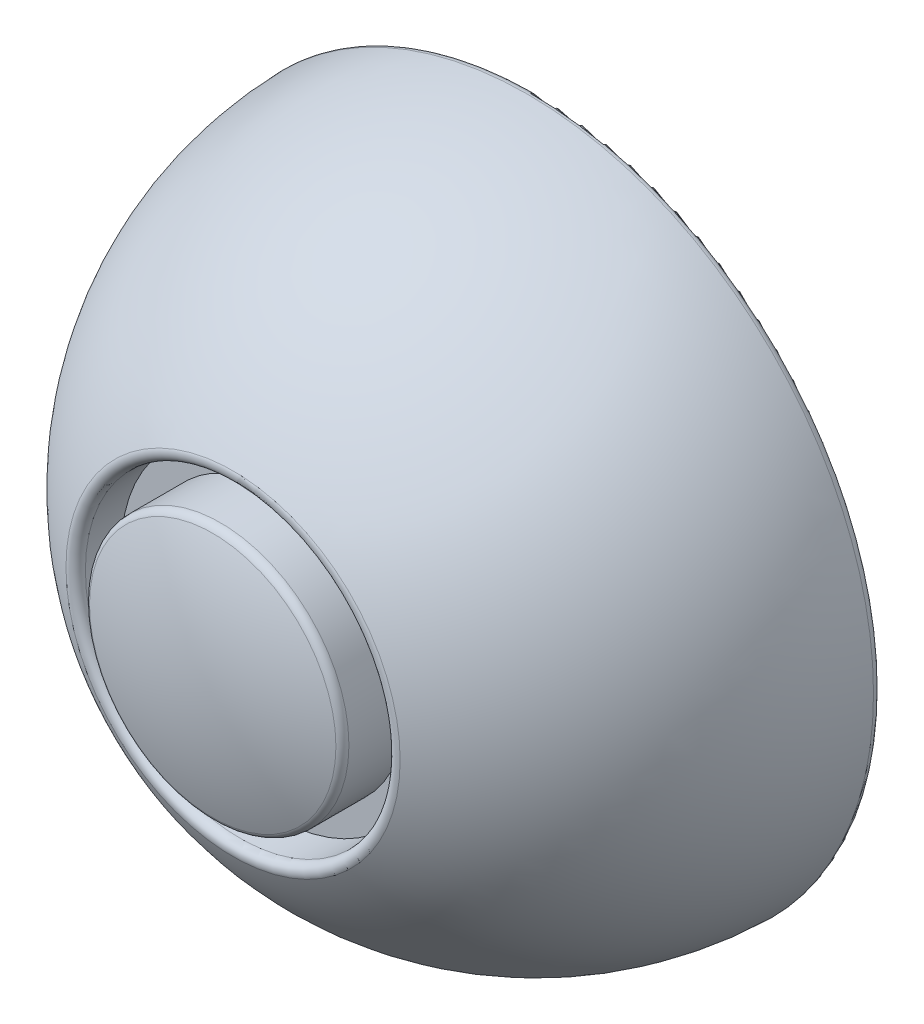
ISO-10303-21;
HEADER;
FILE_DESCRIPTION(('STEP AP214'),'2;1');
FILE_NAME('part.step','',(''),(''),'','','');
FILE_SCHEMA(('AUTOMOTIVE_DESIGN { 1 0 10303 214 1 1 1 1 }'));
ENDSEC;
DATA;
#1=APPLICATION_CONTEXT('core data for automotive mechanical design processes');
#2=APPLICATION_PROTOCOL_DEFINITION('international standard','automotive_design',2000,#1);
#3=PRODUCT_CONTEXT('',#1,'mechanical');
#4=PRODUCT('Part','Part','',(#3));
#5=PRODUCT_RELATED_PRODUCT_CATEGORY('part','',(#4));
#6=PRODUCT_DEFINITION_FORMATION('','',#4);
#7=PRODUCT_DEFINITION_CONTEXT('part definition',#1,'design');
#8=PRODUCT_DEFINITION('design','',#6,#7);
#9=PRODUCT_DEFINITION_SHAPE('','',#8);
#10=(LENGTH_UNIT() NAMED_UNIT(*) SI_UNIT(.MILLI.,.METRE.));
#11=(NAMED_UNIT(*) PLANE_ANGLE_UNIT() SI_UNIT($,.RADIAN.));
#12=(NAMED_UNIT(*) SI_UNIT($,.STERADIAN.) SOLID_ANGLE_UNIT());
#13=UNCERTAINTY_MEASURE_WITH_UNIT(LENGTH_MEASURE(1.E-05),#10,'distance_accuracy_value','');
#14=(GEOMETRIC_REPRESENTATION_CONTEXT(3) GLOBAL_UNCERTAINTY_ASSIGNED_CONTEXT((#13)) GLOBAL_UNIT_ASSIGNED_CONTEXT((#10,
#11,#12)) REPRESENTATION_CONTEXT('',''));
#15=CARTESIAN_POINT('',(0.,0.,0.));
#16=DIRECTION('',(0.,0.,1.));
#17=DIRECTION('',(1.,0.,0.));
#18=AXIS2_PLACEMENT_3D('',#15,#16,#17);
#19=CARTESIAN_POINT('',(0.,0.,0.));
#20=DIRECTION('',(0.,0.,-1.));
#21=DIRECTION('',(1.,0.,0.));
#22=AXIS2_PLACEMENT_3D('',#19,#20,#21);
#23=SPHERICAL_SURFACE('',#22,10.5);
#24=CARTESIAN_POINT('',(0.,0.,0.256097560975609));
#25=DIRECTION('',(0.,0.,-1.));
#26=DIRECTION('',(-1.,0.,0.));
#27=AXIS2_PLACEMENT_3D('',#24,#25,#26);
#28=CIRCLE('',#27,10.4968763943976);
#29=CARTESIAN_POINT('',(10.4968763943976,0.,0.256097560975609));
#30=VERTEX_POINT('',#29);
#31=EDGE_CURVE('E66',#30,#30,#28,.F.);
#32=CARTESIAN_POINT('',(0.,0.,9.19443744621765));
#33=DIRECTION('',(0.,0.,-1.));
#34=DIRECTION('',(-1.,0.,0.));
#35=AXIS2_PLACEMENT_3D('',#32,#33,#34);
#36=CIRCLE('',#35,5.07073170731707);
#37=CARTESIAN_POINT('',(5.07073170731707,0.,9.19443744621765));
#38=VERTEX_POINT('',#37);
#39=EDGE_CURVE('E57',#38,#38,#36,.T.);
#40=CARTESIAN_POINT('',(10.4968763943976,0.,0.256097560975609));
#41=CARTESIAN_POINT('',(10.4940962826482,0.,0.370077232707731));
#42=CARTESIAN_POINT('',(10.4894583226559,0.,0.484011537651241));
#43=CARTESIAN_POINT('',(10.4764747300092,0.,0.711668700190832));
#44=CARTESIAN_POINT('',(10.4681290973549,0.,0.825391557786914));
#45=CARTESIAN_POINT('',(10.4477381832081,0.,1.05250511186145));
#46=CARTESIAN_POINT('',(10.4356929017156,0.,1.1658958083399));
#47=CARTESIAN_POINT('',(10.4079156933777,0.,1.39222473896705));
#48=CARTESIAN_POINT('',(10.3921837665321,0.,1.50516297311575));
#49=CARTESIAN_POINT('',(10.3570499002595,0.,1.73046714185113));
#50=CARTESIAN_POINT('',(10.3376479608324,0.,1.84283307643783));
#51=CARTESIAN_POINT('',(10.2951946719407,0.,2.06687342037519));
#52=CARTESIAN_POINT('',(10.2721433224762,0.,2.17854782972586));
#53=CARTESIAN_POINT('',(10.2224156680047,0.,2.40108663010789));
#54=CARTESIAN_POINT('',(10.1957393629976,0.,2.51195102113924));
#55=CARTESIAN_POINT('',(10.1387901036515,0.,2.73275215158429));
#56=CARTESIAN_POINT('',(10.1085171493125,0.,2.84268889099798));
#57=CARTESIAN_POINT('',(10.0444067123045,0.,3.06151806911693));
#58=CARTESIAN_POINT('',(10.0105692296356,0.,3.1704105078222));
#59=CARTESIAN_POINT('',(9.93936563952546,0.,3.38703554351767));
#60=CARTESIAN_POINT('',(9.90199953208428,0.,3.49476814050788));
#61=CARTESIAN_POINT('',(9.82377833995237,0.,3.70895918241803));
#62=CARTESIAN_POINT('',(9.78292325526165,0.,3.81541762733798));
#63=CARTESIAN_POINT('',(9.6977674581828,0.,4.02694740670112));
#64=CARTESIAN_POINT('',(9.65346674579467,0.,4.13201874114432));
#65=CARTESIAN_POINT('',(9.5614666988707,0.,4.3406628129494));
#66=CARTESIAN_POINT('',(9.51376736433487,0.,4.44423555031129));
#67=CARTESIAN_POINT('',(9.41502068479673,0.,4.64977253144522));
#68=CARTESIAN_POINT('',(9.36397333979444,0.,4.75173677521727));
#69=CARTESIAN_POINT('',(9.25858480343181,0.,4.95394857936527));
#70=CARTESIAN_POINT('',(9.20424361207147,0.,5.05419613974122));
#71=CARTESIAN_POINT('',(9.09232504205782,0.,5.25286820878856));
#72=CARTESIAN_POINT('',(9.03474766340452,0.,5.35129271745995));
#73=CARTESIAN_POINT('',(8.91641781164701,0.,5.54621424915026));
#74=CARTESIAN_POINT('',(8.8556653385428,0.,5.64271127216917));
#75=CARTESIAN_POINT('',(8.73104975967961,0.,5.83367544377746));
#76=CARTESIAN_POINT('',(8.66718665392062,0.,5.92814259236684));
#77=CARTESIAN_POINT('',(8.53641757210045,0.,6.11494678015008));
#78=CARTESIAN_POINT('',(8.46951159603927,0.,6.20728381934395));
#79=CARTESIAN_POINT('',(8.33272776462416,0.,6.38972981353637));
#80=CARTESIAN_POINT('',(8.26284990927024,0.,6.47983876853492));
#81=CARTESIAN_POINT('',(8.12019646361013,0.,6.6577329836593));
#82=CARTESIAN_POINT('',(8.04742087330396,0.,6.74551824378512));
#83=CARTESIAN_POINT('',(7.89904917674092,0.,6.9186719240595));
#84=CARTESIAN_POINT('',(7.82345307048406,0.,7.00404034420805));
#85=CARTESIAN_POINT('',(7.66952055374364,0.,7.17226976382024));
#86=CARTESIAN_POINT('',(7.59118414326009,0.,7.25513076328388));
#87=CARTESIAN_POINT('',(7.43185413742179,0.,7.41825742135729));
#88=CARTESIAN_POINT('',(7.35086054206705,0.,7.49852307996707));
#89=CARTESIAN_POINT('',(7.18630210521116,0.,7.65637388987668));
#90=CARTESIAN_POINT('',(7.10273726371002,0.,7.73395904117651));
#91=CARTESIAN_POINT('',(6.93312500172289,0.,7.88636651451523));
#92=CARTESIAN_POINT('',(6.84707758123691,0.,7.96118883655411));
#93=CARTESIAN_POINT('',(6.6725914618523,0.,8.10799125968401));
#94=CARTESIAN_POINT('',(6.58415276295367,0.,8.17997136077503));
#95=CARTESIAN_POINT('',(6.40497792737928,0.,8.32101297075655));
#96=CARTESIAN_POINT('',(6.31424179070352,0.,8.39007447964705));
#97=CARTESIAN_POINT('',(6.13056834753793,0.,8.52520561330804));
#98=CARTESIAN_POINT('',(6.03763104104809,0.,8.59127523807853));
#99=CARTESIAN_POINT('',(5.84965390053375,0.,8.72035255129015));
#100=CARTESIAN_POINT('',(5.75461406650925,0.,8.78336023973129));
#101=CARTESIAN_POINT('',(5.56253259948371,0.,8.90624663380902));
#102=CARTESIAN_POINT('',(5.46549096648269,0.,8.96612533944562));
#103=CARTESIAN_POINT('',(5.26950929381819,0.,9.08269094892466));
#104=CARTESIAN_POINT('',(5.17056925415472,0.,9.1393778527671));
#105=CARTESIAN_POINT('',(5.07073170731707,0.,9.19443744621765));
#106=B_SPLINE_CURVE_WITH_KNOTS('',3,(#40,#41,#42,#43,#44,#45,#46,#47,#48,#49,#50,#51,#52,#53,
#54,#55,#56,#57,#58,#59,#60,#61,#62,#63,#64,#65,#66,#67,#68,#69,#70,#71,#72,#73,#74,#75,#76,#77,
#78,#79,#80,#81,#82,#83,#84,#85,#86,#87,#88,#89,#90,#91,#92,#93,#94,#95,#96,#97,#98,#99,#100,
#101,#102,#103,#104,#105),.UNSPECIFIED.,.F.,.F.,(4,2,2,2,2,2,2,2,2,2,2,2,2,2,2,2,2,2,2,2,2,2,2,
2,2,2,2,2,2,2,2,2,4),(0.,0.342025525861261,0.684051051722522,1.02607657758378,1.36810210344504,
1.7101276293063,2.05215315516757,2.39417868102883,2.73620420689009,3.07822973275135,
3.42025525861261,3.76228078447387,4.10430631033513,4.44633183619639,4.78835736205765,
5.13038288791891,5.47240841378017,5.81443393964143,6.15645946550269,6.49848499136395,
6.84051051722522,7.18253604308648,7.52456156894774,7.866587094809,8.20861262067026,
8.55063814653152,8.89266367239278,9.23468919825404,9.5767147241153,9.91874024997656,
10.2607657758378,10.6027913016991,10.9448168275603),.UNSPECIFIED.);
#107=EDGE_CURVE('BSEAM32',#30,#38,#106,.T.);
#108=ORIENTED_EDGE('',*,*,#31,.T.);
#109=ORIENTED_EDGE('',*,*,#39,.T.);
#110=ORIENTED_EDGE('',*,*,#107,.T.);
#111=ORIENTED_EDGE('',*,*,#107,.F.);
#112=EDGE_LOOP('',(#108,#110,#109,#111));
#113=FACE_BOUND('',#112,.T.);
#114=ADVANCED_FACE('F32',(#113),#23,.T.);
#115=CARTESIAN_POINT('',(0.,0.,0.));
#116=DIRECTION('',(0.,0.,-1.));
#117=DIRECTION('',(1.,0.,0.));
#118=AXIS2_PLACEMENT_3D('',#115,#116,#117);
#119=SPHERICAL_SURFACE('',#118,10.);
#120=CARTESIAN_POINT('',(0.,0.,0.24390243902439));
#121=DIRECTION('',(0.,0.,-1.));
#122=DIRECTION('',(-1.,0.,0.));
#123=AXIS2_PLACEMENT_3D('',#120,#121,#122);
#124=CIRCLE('',#123,9.99702513752156);
#125=CARTESIAN_POINT('',(9.99702513752156,0.,0.24390243902439));
#126=VERTEX_POINT('',#125);
#127=EDGE_CURVE('E69',#126,#126,#124,.T.);
#128=CARTESIAN_POINT('',(0.,0.,7.2893556754444));
#129=DIRECTION('',(0.,0.,-1.));
#130=DIRECTION('',(-1.,0.,0.));
#131=AXIS2_PLACEMENT_3D('',#128,#129,#130);
#132=CIRCLE('',#131,6.84582309418425);
#133=CARTESIAN_POINT('',(6.84582309418425,0.,7.2893556754444));
#134=VERTEX_POINT('',#133);
#135=EDGE_CURVE('E53',#134,#134,#132,.T.);
#136=CARTESIAN_POINT('',(9.99702513752156,0.,0.24390243902439));
#137=CARTESIAN_POINT('',(9.99501221914017,0.,0.326416763841437));
#138=CARTESIAN_POINT('',(9.99197726358852,0.,0.408906143852506));
#139=CARTESIAN_POINT('',(9.98386612592344,0.,0.573784487878162));
#140=CARTESIAN_POINT('',(9.97878994381001,0.,0.65617345189275));
#141=CARTESIAN_POINT('',(9.96659920080011,0.,0.82080043754092));
#142=CARTESIAN_POINT('',(9.95948463990363,0.,0.903038459174503));
#143=CARTESIAN_POINT('',(9.94322157219036,0.,1.06731314271673));
#144=CARTESIAN_POINT('',(9.93407306537356,0.,1.14934980462537));
#145=CARTESIAN_POINT('',(9.91374769585873,0.,1.31317147040892));
#146=CARTESIAN_POINT('',(9.90257083316069,0.,1.39495647428381));
#147=CARTESIAN_POINT('',(9.87819560960076,0.,1.55822468116913));
#148=CARTESIAN_POINT('',(9.86499724873888,0.,1.63970788417955));
#149=CARTESIAN_POINT('',(9.8365871195152,0.,1.8023225312245));
#150=CARTESIAN_POINT('',(9.8213753511534,0.,1.88345397525903));
#151=CARTESIAN_POINT('',(9.78894773375966,0.,2.04531536199223));
#152=CARTESIAN_POINT('',(9.77173188472772,0.,2.12604530469091));
#153=CARTESIAN_POINT('',(9.7353066610792,0.,2.28705419253355));
#154=CARTESIAN_POINT('',(9.71609728646261,0.,2.36733313767751));
#155=CARTESIAN_POINT('',(9.67569678910186,0.,2.5273908107084));
#156=CARTESIAN_POINT('',(9.6545056663577,0.,2.60716953859532));
#157=CARTESIAN_POINT('',(9.61015466519225,0.,2.76617786409563));
#158=CARTESIAN_POINT('',(9.58699478677096,0.,2.845407461709));
#159=CARTESIAN_POINT('',(9.53872047377146,0.,3.00326895032258));
#160=CARTESIAN_POINT('',(9.51360603919324,0.,3.08190084132278));
#161=CARTESIAN_POINT('',(9.46143801175267,0.,3.23851870682925));
#162=CARTESIAN_POINT('',(9.43438441889032,0.,3.31650468133553));
#163=CARTESIAN_POINT('',(9.37835466166935,0.,3.47178289999034));
#164=CARTESIAN_POINT('',(9.34937849731073,0.,3.54907514413887));
#165=CARTESIAN_POINT('',(9.28952136262985,0.,3.70291851354635));
#166=CARTESIAN_POINT('',(9.25864039230759,0.,3.77946963880529));
#167=CARTESIAN_POINT('',(9.19499257908482,0.,3.93178383628802));
#168=CARTESIAN_POINT('',(9.16222573618431,0.,4.00754690851182));
#169=CARTESIAN_POINT('',(9.09482626743492,0.,4.15823854894071));
#170=CARTESIAN_POINT('',(9.06019364158604,0.,4.23316711714581));
#171=CARTESIAN_POINT('',(8.9890838404972,0.,4.38214381019528));
#172=CARTESIAN_POINT('',(8.95260666525724,0.,4.45619193503965));
#173=CARTESIAN_POINT('',(8.8778301298524,0.,4.60336234183292));
#174=CARTESIAN_POINT('',(8.83953076968753,0.,4.67648462378183));
#175=CARTESIAN_POINT('',(8.76113334609615,0.,4.82175851289163));
#176=CARTESIAN_POINT('',(8.72103528266964,0.,4.89391012005252));
#177=CARTESIAN_POINT('',(8.63906503701841,0.,5.03719842282257));
#178=CARTESIAN_POINT('',(8.59719285479368,0.,5.10833511843173));
#179=CARTESIAN_POINT('',(8.51170004373719,0.,5.24954998358595));
#180=CARTESIAN_POINT('',(8.46807941490542,0.,5.31962815313102));
#181=CARTESIAN_POINT('',(8.37911645481181,0.,5.45868300063434));
#182=CARTESIAN_POINT('',(8.33377412354997,0.,5.52765967859258));
#183=CARTESIAN_POINT('',(8.24139555836986,0.,5.66446925273972));
#184=CARTESIAN_POINT('',(8.19435932445159,0.,5.73230214892862));
#185=CARTESIAN_POINT('',(8.09862179225497,0.,5.86678257059316));
#186=CARTESIAN_POINT('',(8.04992049397663,0.,5.9334300960688));
#187=CARTESIAN_POINT('',(7.95088269230863,0.,6.06549891421222));
#188=CARTESIAN_POINT('',(7.90054618891898,0.,6.13092020688001));
#189=CARTESIAN_POINT('',(7.79826883850953,0.,6.26049644879681));
#190=CARTESIAN_POINT('',(7.74632799148973,0.,6.32465139804583));
#191=CARTESIAN_POINT('',(7.64087380015356,0.,6.45165562015193));
#192=CARTESIAN_POINT('',(7.58736045583717,0.,6.51450489300902));
#193=CARTESIAN_POINT('',(7.47879407581592,0.,6.63885922528212));
#194=CARTESIAN_POINT('',(7.42374104011105,0.,6.70036428469814));
#195=CARTESIAN_POINT('',(7.31212904415078,0.,6.82199249434586));
#196=CARTESIAN_POINT('',(7.25557008389537,0.,6.88211564457755));
#197=CARTESIAN_POINT('',(7.14098086577612,0.,7.00094312334217));
#198=CARTESIAN_POINT('',(7.08295060791227,0.,7.05964745187508));
#199=CARTESIAN_POINT('',(6.96545455941536,0.,7.17560148358798));
#200=CARTESIAN_POINT('',(6.9059887687823,0.,7.23285118676797));
#201=CARTESIAN_POINT('',(6.84582309418425,0.,7.2893556754444));
#202=B_SPLINE_CURVE_WITH_KNOTS('',3,(#136,#137,#138,#139,#140,#141,#142,#143,#144,#145,#146,
#147,#148,#149,#150,#151,#152,#153,#154,#155,#156,#157,#158,#159,#160,#161,#162,#163,#164,#165,
#166,#167,#168,#169,#170,#171,#172,#173,#174,#175,#176,#177,#178,#179,#180,#181,#182,#183,#184,
#185,#186,#187,#188,#189,#190,#191,#192,#193,#194,#195,#196,#197,#198,#199,#200,#201),
.UNSPECIFIED.,.F.,.F.,(4,2,2,2,2,2,2,2,2,2,2,2,2,2,2,2,2,2,2,2,2,2,2,2,2,2,2,2,2,2,2,2,4),(0.,
0.24761027840037,0.49522055680074,0.74283083520111,0.990441113601479,1.23805139200185,
1.48566167040222,1.73327194880259,1.98088222720296,2.22849250560333,2.4761027840037,
2.72371306240407,2.97132334080444,3.21893361920481,3.46654389760518,3.71415417600555,
3.96176445440592,4.20937473280629,4.45698501120666,4.70459528960703,4.9522055680074,
5.19981584640777,5.44742612480814,5.69503640320851,5.94264668160888,6.19025696000925,
6.43786723840962,6.68547751680999,6.93308779521036,7.18069807361073,7.42830835201109,
7.67591863041147,7.92352890881183),.UNSPECIFIED.);
#203=EDGE_CURVE('BSEAM110',#126,#134,#202,.T.);
#204=ORIENTED_EDGE('',*,*,#127,.T.);
#205=ORIENTED_EDGE('',*,*,#135,.F.);
#206=ORIENTED_EDGE('',*,*,#203,.T.);
#207=ORIENTED_EDGE('',*,*,#203,.F.);
#208=EDGE_LOOP('',(#204,#206,#205,#207));
#209=FACE_BOUND('',#208,.T.);
#210=ADVANCED_FACE('F110',(#209),#119,.F.);
#211=CARTESIAN_POINT('',(6.84582309418425,0.,7.2893556754444));
#212=DIRECTION('',(0.,0.,1.));
#213=DIRECTION('',(1.,0.,0.));
#214=AXIS2_PLACEMENT_3D('',#211,#212,#213);
#215=PLANE('',#214);
#216=CARTESIAN_POINT('',(0.,0.,7.2893556754444));
#217=DIRECTION('',(0.,0.,1.));
#218=DIRECTION('',(1.,0.,0.));
#219=AXIS2_PLACEMENT_3D('',#216,#217,#218);
#220=CIRCLE('',#219,1.85);
#221=CARTESIAN_POINT('',(1.85,0.,7.2893556754444));
#222=VERTEX_POINT('',#221);
#223=EDGE_CURVE('E75',#222,#222,#220,.T.);
#224=ORIENTED_EDGE('',*,*,#223,.T.);
#225=EDGE_LOOP('',(#224));
#226=FACE_BOUND('',#225,.T.);
#227=ORIENTED_EDGE('',*,*,#135,.T.);
#228=EDGE_LOOP('',(#227));
#229=FACE_BOUND('',#228,.T.);
#230=ADVANCED_FACE('F116',(#226,#229),#215,.F.);
#231=CARTESIAN_POINT('',(0.,0.,0.));
#232=DIRECTION('',(0.,0.,-1.));
#233=DIRECTION('',(-1.,0.,0.));
#234=AXIS2_PLACEMENT_3D('',#231,#232,#233);
#235=CYLINDRICAL_SURFACE('',#234,1.6);
#236=CARTESIAN_POINT('',(0.,0.,7.5393556754444));
#237=DIRECTION('',(0.,0.,1.));
#238=DIRECTION('',(1.,0.,0.));
#239=AXIS2_PLACEMENT_3D('',#236,#237,#238);
#240=CIRCLE('',#239,1.6);
#241=CARTESIAN_POINT('',(1.6,0.,7.5393556754444));
#242=VERTEX_POINT('',#241);
#243=EDGE_CURVE('E72',#242,#242,#240,.F.);
#244=ORIENTED_EDGE('',*,*,#243,.T.);
#245=EDGE_LOOP('',(#244));
#246=FACE_BOUND('',#245,.T.);
#247=CARTESIAN_POINT('',(0.,0.,8.2893556754444));
#248=DIRECTION('',(0.,0.,-1.));
#249=DIRECTION('',(-1.,0.,0.));
#250=AXIS2_PLACEMENT_3D('',#247,#248,#249);
#251=CIRCLE('',#250,1.6);
#252=CARTESIAN_POINT('',(-1.6,0.,8.2893556754444));
#253=VERTEX_POINT('',#252);
#254=EDGE_CURVE('E51',#253,#253,#251,.T.);
#255=ORIENTED_EDGE('',*,*,#254,.F.);
#256=EDGE_LOOP('',(#255));
#257=FACE_BOUND('',#256,.T.);
#258=ADVANCED_FACE('F47',(#246,#257),#235,.F.);
#259=CARTESIAN_POINT('',(0.,0.,8.2893556754444));
#260=DIRECTION('',(0.,0.,-1.));
#261=DIRECTION('',(-1.,0.,0.));
#262=AXIS2_PLACEMENT_3D('',#259,#260,#261);
#263=CONICAL_SURFACE('',#262,1.6,0.923051066581533);
#264=CARTESIAN_POINT('',(0.,0.,9.5));
#265=VERTEX_POINT('',#264);
#266=VERTEX_LOOP('',#265);
#267=FACE_BOUND('',#266,.T.);
#268=ORIENTED_EDGE('',*,*,#254,.T.);
#269=EDGE_LOOP('',(#268));
#270=FACE_BOUND('',#269,.T.);
#271=ADVANCED_FACE('F43',(#267,#270),#263,.F.);
#272=CARTESIAN_POINT('',(0.,0.,0.));
#273=DIRECTION('',(0.,0.,-1.));
#274=DIRECTION('',(1.,0.,0.));
#275=AXIS2_PLACEMENT_3D('',#272,#273,#274);
#276=SPHERICAL_SURFACE('',#275,10.5);
#277=CARTESIAN_POINT('',(0.,0.,9.81171221597745));
#278=DIRECTION('',(0.,0.,-1.));
#279=DIRECTION('',(-1.,0.,0.));
#280=AXIS2_PLACEMENT_3D('',#277,#278,#279);
#281=CIRCLE('',#280,3.7390243902439);
#282=CARTESIAN_POINT('',(-3.7390243902439,0.,9.81171221597745));
#283=VERTEX_POINT('',#282);
#284=EDGE_CURVE('E40',#283,#283,#281,.F.);
#285=ORIENTED_EDGE('',*,*,#284,.T.);
#286=EDGE_LOOP('',(#285));
#287=FACE_BOUND('',#286,.T.);
#288=ADVANCED_FACE('F46',(#287),#276,.T.);
#289=CARTESIAN_POINT('',(0.,0.,0.));
#290=DIRECTION('',(0.,0.,-1.));
#291=DIRECTION('',(-1.,0.,0.));
#292=AXIS2_PLACEMENT_3D('',#289,#290,#291);
#293=CYLINDRICAL_SURFACE('',#292,3.9);
#294=CARTESIAN_POINT('',(0.,0.,9.57810002035894));
#295=DIRECTION('',(0.,0.,-1.));
#296=DIRECTION('',(-1.,0.,0.));
#297=AXIS2_PLACEMENT_3D('',#294,#295,#296);
#298=CIRCLE('',#297,3.9);
#299=CARTESIAN_POINT('',(-3.9,0.,9.57810002035894));
#300=VERTEX_POINT('',#299);
#301=EDGE_CURVE('E78',#300,#300,#298,.T.);
#302=ORIENTED_EDGE('',*,*,#301,.T.);
#303=EDGE_LOOP('',(#302));
#304=FACE_BOUND('',#303,.T.);
#305=CARTESIAN_POINT('',(0.,0.,7.88935567544441));
#306=DIRECTION('',(0.,0.,-1.));
#307=DIRECTION('',(-1.,0.,0.));
#308=AXIS2_PLACEMENT_3D('',#305,#306,#307);
#309=CIRCLE('',#308,3.9);
#310=CARTESIAN_POINT('',(-3.9,0.,7.88935567544441));
#311=VERTEX_POINT('',#310);
#312=EDGE_CURVE('E54',#311,#311,#309,.T.);
#313=ORIENTED_EDGE('',*,*,#312,.F.);
#314=EDGE_LOOP('',(#313));
#315=FACE_BOUND('',#314,.T.);
#316=ADVANCED_FACE('F91',(#304,#315),#293,.T.);
#317=CARTESIAN_POINT('',(4.7,0.,7.88935567544441));
#318=DIRECTION('',(0.,0.,-1.));
#319=DIRECTION('',(-1.,0.,0.));
#320=AXIS2_PLACEMENT_3D('',#317,#318,#319);
#321=PLANE('',#320);
#322=CARTESIAN_POINT('',(0.,0.,7.8893556754444));
#323=DIRECTION('',(0.,0.,-1.));
#324=DIRECTION('',(-1.,0.,0.));
#325=AXIS2_PLACEMENT_3D('',#322,#323,#324);
#326=CIRCLE('',#325,4.7);
#327=CARTESIAN_POINT('',(-4.7,0.,7.8893556754444));
#328=VERTEX_POINT('',#327);
#329=EDGE_CURVE('E60',#328,#328,#326,.T.);
#330=ORIENTED_EDGE('',*,*,#329,.F.);
#331=EDGE_LOOP('',(#330));
#332=FACE_BOUND('',#331,.T.);
#333=ORIENTED_EDGE('',*,*,#312,.T.);
#334=EDGE_LOOP('',(#333));
#335=FACE_BOUND('',#334,.T.);
#336=ADVANCED_FACE('F94',(#332,#335),#321,.F.);
#337=CARTESIAN_POINT('',(0.,0.,0.));
#338=DIRECTION('',(0.,0.,-1.));
#339=DIRECTION('',(-1.,0.,0.));
#340=AXIS2_PLACEMENT_3D('',#337,#338,#339);
#341=CYLINDRICAL_SURFACE('',#340,4.7);
#342=CARTESIAN_POINT('',(0.,0.,8.97552226892675));
#343=DIRECTION('',(0.,0.,-1.));
#344=DIRECTION('',(-1.,0.,0.));
#345=AXIS2_PLACEMENT_3D('',#342,#343,#344);
#346=CIRCLE('',#345,4.7);
#347=CARTESIAN_POINT('',(-4.7,0.,8.97552226892675));
#348=VERTEX_POINT('',#347);
#349=EDGE_CURVE('E11',#348,#348,#346,.F.);
#350=ORIENTED_EDGE('',*,*,#349,.T.);
#351=EDGE_LOOP('',(#350));
#352=FACE_BOUND('',#351,.T.);
#353=ORIENTED_EDGE('',*,*,#329,.T.);
#354=EDGE_LOOP('',(#353));
#355=FACE_BOUND('',#354,.T.);
#356=ADVANCED_FACE('F99',(#352,#355),#341,.F.);
#357=CARTESIAN_POINT('',(0.,0.,0.25));
#358=DIRECTION('',(0.,0.,1.));
#359=DIRECTION('',(1.,0.,0.));
#360=AXIS2_PLACEMENT_3D('',#357,#358,#359);
#361=TOROIDAL_SURFACE('',#360,10.2469507659596,0.25);
#362=ORIENTED_EDGE('',*,*,#127,.F.);
#363=EDGE_LOOP('',(#362));
#364=FACE_BOUND('',#363,.T.);
#365=CARTESIAN_POINT('',(0.,0.,0.));
#366=DIRECTION('',(0.,0.,1.));
#367=DIRECTION('',(1.,0.,0.));
#368=AXIS2_PLACEMENT_3D('',#365,#366,#367);
#369=CIRCLE('',#368,10.2469507659596);
#370=CARTESIAN_POINT('',(10.2469507659596,0.,0.));
#371=VERTEX_POINT('',#370);
#372=EDGE_CURVE('E36',#371,#371,#369,.T.);
#373=ORIENTED_EDGE('',*,*,#372,.F.);
#374=EDGE_LOOP('',(#373));
#375=FACE_BOUND('',#374,.T.);
#376=ADVANCED_FACE('F105',(#364,#375),#361,.T.);
#377=CARTESIAN_POINT('',(0.,0.,0.25));
#378=DIRECTION('',(0.,0.,1.));
#379=DIRECTION('',(1.,0.,0.));
#380=AXIS2_PLACEMENT_3D('',#377,#378,#379);
#381=TOROIDAL_SURFACE('',#380,10.2469507659596,0.25);
#382=ORIENTED_EDGE('',*,*,#31,.F.);
#383=EDGE_LOOP('',(#382));
#384=FACE_BOUND('',#383,.T.);
#385=ORIENTED_EDGE('',*,*,#372,.T.);
#386=EDGE_LOOP('',(#385));
#387=FACE_BOUND('',#386,.T.);
#388=ADVANCED_FACE('F122',(#384,#387),#381,.T.);
#389=CARTESIAN_POINT('',(0.,0.,7.5393556754444));
#390=DIRECTION('',(0.,0.,1.));
#391=DIRECTION('',(1.,0.,0.));
#392=AXIS2_PLACEMENT_3D('',#389,#390,#391);
#393=TOROIDAL_SURFACE('',#392,1.85,0.25);
#394=ORIENTED_EDGE('',*,*,#223,.F.);
#395=EDGE_LOOP('',(#394));
#396=FACE_BOUND('',#395,.T.);
#397=ORIENTED_EDGE('',*,*,#243,.F.);
#398=EDGE_LOOP('',(#397));
#399=FACE_BOUND('',#398,.T.);
#400=ADVANCED_FACE('F88',(#396,#399),#393,.T.);
#401=CARTESIAN_POINT('',(0.,0.,9.57810002035894));
#402=DIRECTION('',(0.,0.,-1.));
#403=DIRECTION('',(-1.,0.,0.));
#404=AXIS2_PLACEMENT_3D('',#401,#402,#403);
#405=TOROIDAL_SURFACE('',#404,3.65,0.25);
#406=ORIENTED_EDGE('',*,*,#284,.F.);
#407=EDGE_LOOP('',(#406));
#408=FACE_BOUND('',#407,.T.);
#409=ORIENTED_EDGE('',*,*,#301,.F.);
#410=EDGE_LOOP('',(#409));
#411=FACE_BOUND('',#410,.T.);
#412=ADVANCED_FACE('F85',(#408,#411),#405,.T.);
#413=CARTESIAN_POINT('',(0.,0.,8.97552226892675));
#414=DIRECTION('',(0.,0.,-1.));
#415=DIRECTION('',(-1.,0.,0.));
#416=AXIS2_PLACEMENT_3D('',#413,#414,#415);
#417=TOROIDAL_SURFACE('',#416,4.95,0.25);
#418=ORIENTED_EDGE('',*,*,#349,.F.);
#419=EDGE_LOOP('',(#418));
#420=FACE_BOUND('',#419,.T.);
#421=ORIENTED_EDGE('',*,*,#39,.F.);
#422=EDGE_LOOP('',(#421));
#423=FACE_BOUND('',#422,.T.);
#424=ADVANCED_FACE('F34',(#420,#423),#417,.T.);
#425=CLOSED_SHELL('',(#114,#210,#230,#258,#271,#288,#316,#336,#356,#376,#388,#400,#412,#424));
#426=MANIFOLD_SOLID_BREP('B2',#425);
#427=ADVANCED_BREP_SHAPE_REPRESENTATION('',(#18,#426),#14);
#428=SHAPE_DEFINITION_REPRESENTATION(#9,#427);
ENDSEC;
END-ISO-10303-21;
